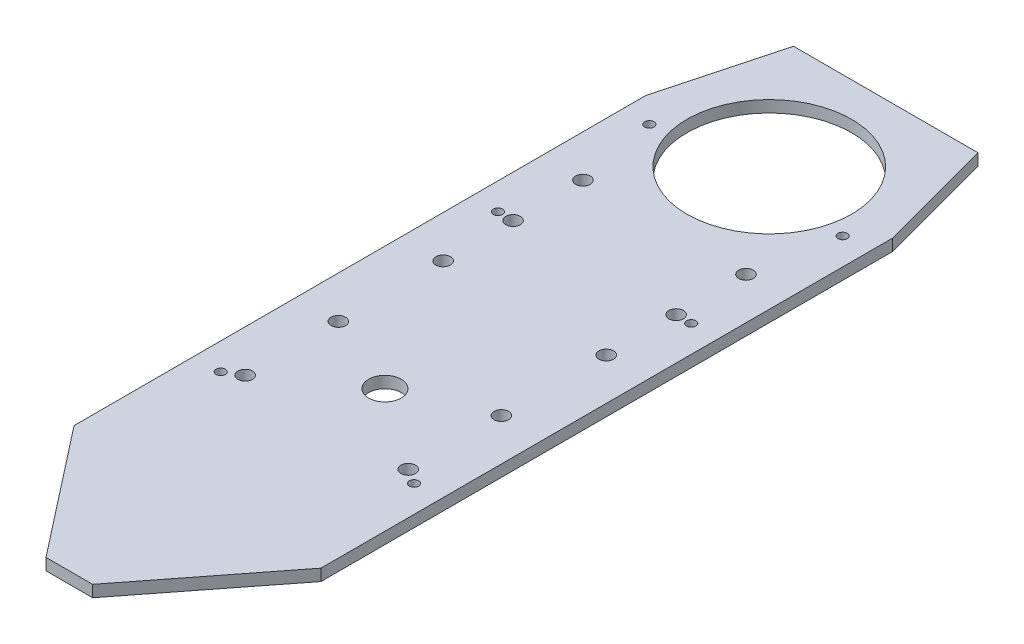
ISO-10303-21;
HEADER;
FILE_DESCRIPTION(('STEP AP214'),'2;1');
FILE_NAME('part.step','',(''),(''),'','','');
FILE_SCHEMA(('AUTOMOTIVE_DESIGN { 1 0 10303 214 1 1 1 1 }'));
ENDSEC;
DATA;
#1=APPLICATION_CONTEXT('core data for automotive mechanical design processes');
#2=APPLICATION_PROTOCOL_DEFINITION('international standard','automotive_design',2000,#1);
#3=PRODUCT_CONTEXT('',#1,'mechanical');
#4=PRODUCT('Part','Part','',(#3));
#5=PRODUCT_RELATED_PRODUCT_CATEGORY('part','',(#4));
#6=PRODUCT_DEFINITION_FORMATION('','',#4);
#7=PRODUCT_DEFINITION_CONTEXT('part definition',#1,'design');
#8=PRODUCT_DEFINITION('design','',#6,#7);
#9=PRODUCT_DEFINITION_SHAPE('','',#8);
#10=(LENGTH_UNIT() NAMED_UNIT(*) SI_UNIT(.MILLI.,.METRE.));
#11=(NAMED_UNIT(*) PLANE_ANGLE_UNIT() SI_UNIT($,.RADIAN.));
#12=(NAMED_UNIT(*) SI_UNIT($,.STERADIAN.) SOLID_ANGLE_UNIT());
#13=UNCERTAINTY_MEASURE_WITH_UNIT(LENGTH_MEASURE(1.E-05),#10,'distance_accuracy_value','');
#14=(GEOMETRIC_REPRESENTATION_CONTEXT(3) GLOBAL_UNCERTAINTY_ASSIGNED_CONTEXT((#13)) GLOBAL_UNIT_ASSIGNED_CONTEXT((#10,
#11,#12)) REPRESENTATION_CONTEXT('',''));
#15=CARTESIAN_POINT('',(0.,0.,0.));
#16=DIRECTION('',(0.,0.,1.));
#17=DIRECTION('',(1.,0.,0.));
#18=AXIS2_PLACEMENT_3D('',#15,#16,#17);
#19=CARTESIAN_POINT('',(0.,10.,0.));
#20=DIRECTION('',(0.,-1.,0.));
#21=DIRECTION('',(0.,0.,-1.));
#22=AXIS2_PLACEMENT_3D('',#19,#20,#21);
#23=PLANE('',#22);
#24=CARTESIAN_POINT('',(-70.,10.,380.));
#25=DIRECTION('',(0.,1.,0.));
#26=DIRECTION('',(0.,0.,1.));
#27=AXIS2_PLACEMENT_3D('',#24,#25,#26);
#28=CIRCLE('',#27,6.25);
#29=CARTESIAN_POINT('',(-70.,10.,386.25));
#30=VERTEX_POINT('',#29);
#31=EDGE_CURVE('E202',#30,#30,#28,.T.);
#32=ORIENTED_EDGE('',*,*,#31,.F.);
#33=EDGE_LOOP('',(#32));
#34=FACE_BOUND('',#33,.T.);
#35=CARTESIAN_POINT('',(83.,10.,20.));
#36=DIRECTION('',(0.,1.,0.));
#37=DIRECTION('',(0.,0.,-1.));
#38=AXIS2_PLACEMENT_3D('',#35,#36,#37);
#39=CIRCLE('',#38,4.00000000000001);
#40=CARTESIAN_POINT('',(83.,10.,16.));
#41=VERTEX_POINT('',#40);
#42=EDGE_CURVE('E225',#41,#41,#39,.T.);
#43=ORIENTED_EDGE('',*,*,#42,.F.);
#44=EDGE_LOOP('',(#43));
#45=FACE_BOUND('',#44,.T.);
#46=CARTESIAN_POINT('',(-70.,10.,300.));
#47=DIRECTION('',(0.,1.,0.));
#48=DIRECTION('',(0.,0.,1.));
#49=AXIS2_PLACEMENT_3D('',#46,#47,#48);
#50=CIRCLE('',#49,6.25);
#51=CARTESIAN_POINT('',(-70.,10.,306.25));
#52=VERTEX_POINT('',#51);
#53=EDGE_CURVE('E226',#52,#52,#50,.T.);
#54=ORIENTED_EDGE('',*,*,#53,.F.);
#55=EDGE_LOOP('',(#54));
#56=FACE_BOUND('',#55,.T.);
#57=CARTESIAN_POINT('',(-70.,10.,210.));
#58=DIRECTION('',(0.,1.,0.));
#59=DIRECTION('',(0.,0.,1.));
#60=AXIS2_PLACEMENT_3D('',#57,#58,#59);
#61=CIRCLE('',#60,6.25);
#62=CARTESIAN_POINT('',(-70.,10.,216.25));
#63=VERTEX_POINT('',#62);
#64=EDGE_CURVE('E237',#63,#63,#61,.T.);
#65=ORIENTED_EDGE('',*,*,#64,.F.);
#66=EDGE_LOOP('',(#65));
#67=FACE_BOUND('',#66,.T.);
#68=CARTESIAN_POINT('',(-83.,10.,20.));
#69=DIRECTION('',(0.,1.,0.));
#70=DIRECTION('',(0.,0.,1.));
#71=AXIS2_PLACEMENT_3D('',#68,#69,#70);
#72=CIRCLE('',#71,4.00000000000001);
#73=CARTESIAN_POINT('',(-83.,10.,24.));
#74=VERTEX_POINT('',#73);
#75=EDGE_CURVE('E201',#74,#74,#72,.T.);
#76=ORIENTED_EDGE('',*,*,#75,.F.);
#77=EDGE_LOOP('',(#76));
#78=FACE_BOUND('',#77,.T.);
#79=CARTESIAN_POINT('',(83.,10.,150.));
#80=DIRECTION('',(0.,1.,0.));
#81=DIRECTION('',(0.,0.,-1.));
#82=AXIS2_PLACEMENT_3D('',#79,#80,#81);
#83=CIRCLE('',#82,4.00000000000002);
#84=CARTESIAN_POINT('',(83.,10.,146.));
#85=VERTEX_POINT('',#84);
#86=EDGE_CURVE('E208',#85,#85,#83,.T.);
#87=ORIENTED_EDGE('',*,*,#86,.F.);
#88=EDGE_LOOP('',(#87));
#89=FACE_BOUND('',#88,.T.);
#90=CARTESIAN_POINT('',(83.,10.,388.));
#91=DIRECTION('',(0.,1.,0.));
#92=DIRECTION('',(0.,0.,-1.));
#93=AXIS2_PLACEMENT_3D('',#90,#91,#92);
#94=CIRCLE('',#93,4.00000000000002);
#95=CARTESIAN_POINT('',(83.,10.,384.));
#96=VERTEX_POINT('',#95);
#97=EDGE_CURVE('E214',#96,#96,#94,.T.);
#98=ORIENTED_EDGE('',*,*,#97,.F.);
#99=EDGE_LOOP('',(#98));
#100=FACE_BOUND('',#99,.T.);
#101=CARTESIAN_POINT('',(-82.9999999999999,10.,388.));
#102=DIRECTION('',(0.,1.,0.));
#103=DIRECTION('',(0.,0.,1.));
#104=AXIS2_PLACEMENT_3D('',#101,#102,#103);
#105=CIRCLE('',#104,4.00000000000002);
#106=CARTESIAN_POINT('',(-82.9999999999999,10.,392.));
#107=VERTEX_POINT('',#106);
#108=EDGE_CURVE('E195',#107,#107,#105,.T.);
#109=ORIENTED_EDGE('',*,*,#108,.F.);
#110=EDGE_LOOP('',(#109));
#111=FACE_BOUND('',#110,.T.);
#112=CARTESIAN_POINT('',(-70.,10.,150.));
#113=DIRECTION('',(0.,1.,0.));
#114=DIRECTION('',(0.,0.,1.));
#115=AXIS2_PLACEMENT_3D('',#112,#113,#114);
#116=CIRCLE('',#115,6.25);
#117=CARTESIAN_POINT('',(-70.,10.,156.25));
#118=VERTEX_POINT('',#117);
#119=EDGE_CURVE('E238',#118,#118,#116,.T.);
#120=ORIENTED_EDGE('',*,*,#119,.F.);
#121=EDGE_LOOP('',(#120));
#122=FACE_BOUND('',#121,.T.);
#123=CARTESIAN_POINT('',(-70.,10.,90.));
#124=DIRECTION('',(0.,1.,0.));
#125=DIRECTION('',(0.,0.,1.));
#126=AXIS2_PLACEMENT_3D('',#123,#124,#125);
#127=CIRCLE('',#126,6.25);
#128=CARTESIAN_POINT('',(-70.,10.,96.25));
#129=VERTEX_POINT('',#128);
#130=EDGE_CURVE('E279',#129,#129,#127,.T.);
#131=ORIENTED_EDGE('',*,*,#130,.F.);
#132=EDGE_LOOP('',(#131));
#133=FACE_BOUND('',#132,.T.);
#134=CARTESIAN_POINT('',(70.,10.,90.));
#135=DIRECTION('',(0.,1.,0.));
#136=DIRECTION('',(0.,0.,-1.));
#137=AXIS2_PLACEMENT_3D('',#134,#135,#136);
#138=CIRCLE('',#137,6.25);
#139=CARTESIAN_POINT('',(70.,10.,83.75));
#140=VERTEX_POINT('',#139);
#141=EDGE_CURVE('E273',#140,#140,#138,.T.);
#142=ORIENTED_EDGE('',*,*,#141,.F.);
#143=EDGE_LOOP('',(#142));
#144=FACE_BOUND('',#143,.T.);
#145=CARTESIAN_POINT('',(70.,10.,150.));
#146=DIRECTION('',(0.,1.,0.));
#147=DIRECTION('',(0.,0.,-1.));
#148=AXIS2_PLACEMENT_3D('',#145,#146,#147);
#149=CIRCLE('',#148,6.25);
#150=CARTESIAN_POINT('',(70.,10.,143.75));
#151=VERTEX_POINT('',#150);
#152=EDGE_CURVE('E267',#151,#151,#149,.T.);
#153=ORIENTED_EDGE('',*,*,#152,.F.);
#154=EDGE_LOOP('',(#153));
#155=FACE_BOUND('',#154,.T.);
#156=CARTESIAN_POINT('',(70.,10.,210.));
#157=DIRECTION('',(0.,1.,0.));
#158=DIRECTION('',(0.,0.,-1.));
#159=AXIS2_PLACEMENT_3D('',#156,#157,#158);
#160=CIRCLE('',#159,6.25);
#161=CARTESIAN_POINT('',(70.,10.,203.75));
#162=VERTEX_POINT('',#161);
#163=EDGE_CURVE('E261',#162,#162,#160,.T.);
#164=ORIENTED_EDGE('',*,*,#163,.F.);
#165=EDGE_LOOP('',(#164));
#166=FACE_BOUND('',#165,.T.);
#167=CARTESIAN_POINT('',(70.,10.,300.));
#168=DIRECTION('',(0.,1.,0.));
#169=DIRECTION('',(0.,0.,-1.));
#170=AXIS2_PLACEMENT_3D('',#167,#168,#169);
#171=CIRCLE('',#170,6.25);
#172=CARTESIAN_POINT('',(70.,10.,293.75));
#173=VERTEX_POINT('',#172);
#174=EDGE_CURVE('E255',#173,#173,#171,.T.);
#175=ORIENTED_EDGE('',*,*,#174,.F.);
#176=EDGE_LOOP('',(#175));
#177=FACE_BOUND('',#176,.T.);
#178=CARTESIAN_POINT('',(70.,10.,380.));
#179=DIRECTION('',(0.,1.,0.));
#180=DIRECTION('',(0.,0.,-1.));
#181=AXIS2_PLACEMENT_3D('',#178,#179,#180);
#182=CIRCLE('',#181,6.25);
#183=CARTESIAN_POINT('',(70.,10.,373.75));
#184=VERTEX_POINT('',#183);
#185=EDGE_CURVE('E249',#184,#184,#182,.T.);
#186=ORIENTED_EDGE('',*,*,#185,.F.);
#187=EDGE_LOOP('',(#186));
#188=FACE_BOUND('',#187,.T.);
#189=CARTESIAN_POINT('',(-82.9999999999999,10.,150.));
#190=DIRECTION('',(0.,1.,0.));
#191=DIRECTION('',(0.,0.,1.));
#192=AXIS2_PLACEMENT_3D('',#189,#190,#191);
#193=CIRCLE('',#192,4.00000000000002);
#194=CARTESIAN_POINT('',(-82.9999999999999,10.,154.));
#195=VERTEX_POINT('',#194);
#196=EDGE_CURVE('E189',#195,#195,#193,.T.);
#197=ORIENTED_EDGE('',*,*,#196,.F.);
#198=EDGE_LOOP('',(#197));
#199=FACE_BOUND('',#198,.T.);
#200=DIRECTION('',(0.615661475325656,0.,0.788010753606723));
#201=VECTOR('',#200,1.);
#202=CARTESIAN_POINT('',(-19.9999999999999,10.,601.));
#203=LINE('',#202,#201);
#204=CARTESIAN_POINT('',(-106.,10.,490.925019631395));
#205=VERTEX_POINT('',#204);
#206=CARTESIAN_POINT('',(-19.9999999999999,10.,601.));
#207=VERTEX_POINT('',#206);
#208=EDGE_CURVE('E146',#205,#207,#203,.T.);
#209=ORIENTED_EDGE('',*,*,#208,.T.);
#210=DIRECTION('',(1.,0.,0.));
#211=VECTOR('',#210,1.);
#212=CARTESIAN_POINT('',(-19.9999999999999,10.,601.));
#213=LINE('',#212,#211);
#214=CARTESIAN_POINT('',(20.0000000000001,10.,601.));
#215=VERTEX_POINT('',#214);
#216=EDGE_CURVE('E94',#207,#215,#213,.T.);
#217=ORIENTED_EDGE('',*,*,#216,.T.);
#218=DIRECTION('',(0.615661475325656,0.,-0.788010753606723));
#219=VECTOR('',#218,1.);
#220=CARTESIAN_POINT('',(20.0000000000001,10.,601.));
#221=LINE('',#220,#219);
#222=CARTESIAN_POINT('',(106.,10.,490.925019631395));
#223=VERTEX_POINT('',#222);
#224=EDGE_CURVE('E161',#215,#223,#221,.T.);
#225=ORIENTED_EDGE('',*,*,#224,.T.);
#226=DIRECTION('',(0.,0.,-1.));
#227=VECTOR('',#226,1.);
#228=CARTESIAN_POINT('',(106.,10.,490.925019631395));
#229=LINE('',#228,#227);
#230=CARTESIAN_POINT('',(106.,10.,0.));
#231=VERTEX_POINT('',#230);
#232=EDGE_CURVE('E174',#223,#231,#229,.T.);
#233=ORIENTED_EDGE('',*,*,#232,.T.);
#234=DIRECTION('',(-0.258819045102525,0.,-0.965925826289067));
#235=VECTOR('',#234,1.);
#236=CARTESIAN_POINT('',(106.,10.,0.));
#237=LINE('',#236,#235);
#238=CARTESIAN_POINT('',(79.2050807568873,10.,-100.));
#239=VERTEX_POINT('',#238);
#240=EDGE_CURVE('E113',#231,#239,#237,.T.);
#241=ORIENTED_EDGE('',*,*,#240,.T.);
#242=DIRECTION('',(-1.,0.,0.));
#243=VECTOR('',#242,1.);
#244=CARTESIAN_POINT('',(79.2050807568873,10.,-100.));
#245=LINE('',#244,#243);
#246=CARTESIAN_POINT('',(-79.2050807568874,10.,-100.));
#247=VERTEX_POINT('',#246);
#248=EDGE_CURVE('E107',#239,#247,#245,.T.);
#249=ORIENTED_EDGE('',*,*,#248,.T.);
#250=DIRECTION('',(-0.258819045102525,0.,0.965925826289067));
#251=VECTOR('',#250,1.);
#252=CARTESIAN_POINT('',(-106.,10.,0.));
#253=LINE('',#252,#251);
#254=CARTESIAN_POINT('',(-106.,10.,0.));
#255=VERTEX_POINT('',#254);
#256=EDGE_CURVE('E111',#247,#255,#253,.T.);
#257=ORIENTED_EDGE('',*,*,#256,.T.);
#258=DIRECTION('',(0.,0.,1.));
#259=VECTOR('',#258,1.);
#260=CARTESIAN_POINT('',(-106.,10.,490.925019631395));
#261=LINE('',#260,#259);
#262=EDGE_CURVE('E51',#255,#205,#261,.T.);
#263=ORIENTED_EDGE('',*,*,#262,.T.);
#264=EDGE_LOOP('',(#209,#217,#225,#233,#241,#249,#257,#263));
#265=FACE_BOUND('',#264,.T.);
#266=CARTESIAN_POINT('',(0.,10.,0.));
#267=DIRECTION('',(0.,1.,0.));
#268=DIRECTION('',(0.,0.,1.));
#269=AXIS2_PLACEMENT_3D('',#266,#267,#268);
#270=CIRCLE('',#269,70.65);
#271=CARTESIAN_POINT('',(0.,10.,70.65));
#272=VERTEX_POINT('',#271);
#273=EDGE_CURVE('E135',#272,#272,#270,.T.);
#274=ORIENTED_EDGE('',*,*,#273,.F.);
#275=EDGE_LOOP('',(#274));
#276=FACE_BOUND('',#275,.T.);
#277=CARTESIAN_POINT('',(0.,10.,330.));
#278=DIRECTION('',(0.,1.,0.));
#279=DIRECTION('',(0.,0.,1.));
#280=AXIS2_PLACEMENT_3D('',#277,#278,#279);
#281=CIRCLE('',#280,14.);
#282=CARTESIAN_POINT('',(0.,10.,344.));
#283=VERTEX_POINT('',#282);
#284=EDGE_CURVE('E183',#283,#283,#281,.T.);
#285=ORIENTED_EDGE('',*,*,#284,.F.);
#286=EDGE_LOOP('',(#285));
#287=FACE_BOUND('',#286,.T.);
#288=ADVANCED_FACE('F34',(#34,#45,#56,#67,#78,#89,#100,#111,#122,#133,#144,#155,#166,#177,#188,
#199,#265,#276,#287),#23,.F.);
#289=CARTESIAN_POINT('',(0.,0.,0.));
#290=DIRECTION('',(0.,-1.,0.));
#291=DIRECTION('',(0.,0.,-1.));
#292=AXIS2_PLACEMENT_3D('',#289,#290,#291);
#293=PLANE('',#292);
#294=CARTESIAN_POINT('',(-70.,0.,380.));
#295=DIRECTION('',(0.,-1.,0.));
#296=DIRECTION('',(0.,0.,-1.));
#297=AXIS2_PLACEMENT_3D('',#294,#295,#296);
#298=CIRCLE('',#297,6.25);
#299=CARTESIAN_POINT('',(-70.,0.,373.75));
#300=VERTEX_POINT('',#299);
#301=EDGE_CURVE('E229',#300,#300,#298,.F.);
#302=ORIENTED_EDGE('',*,*,#301,.T.);
#303=EDGE_LOOP('',(#302));
#304=FACE_BOUND('',#303,.T.);
#305=CARTESIAN_POINT('',(83.,0.,20.));
#306=DIRECTION('',(0.,-1.,0.));
#307=DIRECTION('',(0.,0.,-1.));
#308=AXIS2_PLACEMENT_3D('',#305,#306,#307);
#309=CIRCLE('',#308,4.00000000000001);
#310=CARTESIAN_POINT('',(83.,0.,16.));
#311=VERTEX_POINT('',#310);
#312=EDGE_CURVE('E222',#311,#311,#309,.F.);
#313=ORIENTED_EDGE('',*,*,#312,.T.);
#314=EDGE_LOOP('',(#313));
#315=FACE_BOUND('',#314,.T.);
#316=CARTESIAN_POINT('',(-70.,0.,300.));
#317=DIRECTION('',(0.,-1.,0.));
#318=DIRECTION('',(0.,0.,-1.));
#319=AXIS2_PLACEMENT_3D('',#316,#317,#318);
#320=CIRCLE('',#319,6.25);
#321=CARTESIAN_POINT('',(-70.,0.,293.75));
#322=VERTEX_POINT('',#321);
#323=EDGE_CURVE('E241',#322,#322,#320,.F.);
#324=ORIENTED_EDGE('',*,*,#323,.T.);
#325=EDGE_LOOP('',(#324));
#326=FACE_BOUND('',#325,.T.);
#327=CARTESIAN_POINT('',(-70.,0.,210.));
#328=DIRECTION('',(0.,-1.,0.));
#329=DIRECTION('',(0.,0.,-1.));
#330=AXIS2_PLACEMENT_3D('',#327,#328,#329);
#331=CIRCLE('',#330,6.25);
#332=CARTESIAN_POINT('',(-70.,0.,203.75));
#333=VERTEX_POINT('',#332);
#334=EDGE_CURVE('E234',#333,#333,#331,.F.);
#335=ORIENTED_EDGE('',*,*,#334,.T.);
#336=EDGE_LOOP('',(#335));
#337=FACE_BOUND('',#336,.T.);
#338=CARTESIAN_POINT('',(-83.,0.,20.));
#339=DIRECTION('',(0.,-1.,0.));
#340=DIRECTION('',(0.,0.,-1.));
#341=AXIS2_PLACEMENT_3D('',#338,#339,#340);
#342=CIRCLE('',#341,4.00000000000001);
#343=CARTESIAN_POINT('',(-83.,0.,16.));
#344=VERTEX_POINT('',#343);
#345=EDGE_CURVE('E198',#344,#344,#342,.F.);
#346=ORIENTED_EDGE('',*,*,#345,.T.);
#347=EDGE_LOOP('',(#346));
#348=FACE_BOUND('',#347,.T.);
#349=CARTESIAN_POINT('',(83.,0.,150.));
#350=DIRECTION('',(0.,-1.,0.));
#351=DIRECTION('',(0.,0.,-1.));
#352=AXIS2_PLACEMENT_3D('',#349,#350,#351);
#353=CIRCLE('',#352,4.00000000000002);
#354=CARTESIAN_POINT('',(83.,0.,146.));
#355=VERTEX_POINT('',#354);
#356=EDGE_CURVE('E205',#355,#355,#353,.F.);
#357=ORIENTED_EDGE('',*,*,#356,.T.);
#358=EDGE_LOOP('',(#357));
#359=FACE_BOUND('',#358,.T.);
#360=CARTESIAN_POINT('',(83.,0.,388.));
#361=DIRECTION('',(0.,-1.,0.));
#362=DIRECTION('',(0.,0.,-1.));
#363=AXIS2_PLACEMENT_3D('',#360,#361,#362);
#364=CIRCLE('',#363,4.00000000000002);
#365=CARTESIAN_POINT('',(83.,0.,384.));
#366=VERTEX_POINT('',#365);
#367=EDGE_CURVE('E211',#366,#366,#364,.F.);
#368=ORIENTED_EDGE('',*,*,#367,.T.);
#369=EDGE_LOOP('',(#368));
#370=FACE_BOUND('',#369,.T.);
#371=CARTESIAN_POINT('',(-82.9999999999999,0.,388.));
#372=DIRECTION('',(0.,-1.,0.));
#373=DIRECTION('',(0.,0.,-1.));
#374=AXIS2_PLACEMENT_3D('',#371,#372,#373);
#375=CIRCLE('',#374,4.00000000000002);
#376=CARTESIAN_POINT('',(-82.9999999999999,0.,384.));
#377=VERTEX_POINT('',#376);
#378=EDGE_CURVE('E217',#377,#377,#375,.F.);
#379=ORIENTED_EDGE('',*,*,#378,.T.);
#380=EDGE_LOOP('',(#379));
#381=FACE_BOUND('',#380,.T.);
#382=CARTESIAN_POINT('',(-70.,0.,150.));
#383=DIRECTION('',(0.,-1.,0.));
#384=DIRECTION('',(0.,0.,-1.));
#385=AXIS2_PLACEMENT_3D('',#382,#383,#384);
#386=CIRCLE('',#385,6.25);
#387=CARTESIAN_POINT('',(-70.,0.,143.75));
#388=VERTEX_POINT('',#387);
#389=EDGE_CURVE('E282',#388,#388,#386,.F.);
#390=ORIENTED_EDGE('',*,*,#389,.T.);
#391=EDGE_LOOP('',(#390));
#392=FACE_BOUND('',#391,.T.);
#393=CARTESIAN_POINT('',(-70.,0.,90.));
#394=DIRECTION('',(0.,-1.,0.));
#395=DIRECTION('',(0.,0.,-1.));
#396=AXIS2_PLACEMENT_3D('',#393,#394,#395);
#397=CIRCLE('',#396,6.25);
#398=CARTESIAN_POINT('',(-70.,0.,83.75));
#399=VERTEX_POINT('',#398);
#400=EDGE_CURVE('E276',#399,#399,#397,.F.);
#401=ORIENTED_EDGE('',*,*,#400,.T.);
#402=EDGE_LOOP('',(#401));
#403=FACE_BOUND('',#402,.T.);
#404=CARTESIAN_POINT('',(70.,0.,90.));
#405=DIRECTION('',(0.,-1.,0.));
#406=DIRECTION('',(0.,0.,-1.));
#407=AXIS2_PLACEMENT_3D('',#404,#405,#406);
#408=CIRCLE('',#407,6.25);
#409=CARTESIAN_POINT('',(70.,0.,83.75));
#410=VERTEX_POINT('',#409);
#411=EDGE_CURVE('E270',#410,#410,#408,.F.);
#412=ORIENTED_EDGE('',*,*,#411,.T.);
#413=EDGE_LOOP('',(#412));
#414=FACE_BOUND('',#413,.T.);
#415=CARTESIAN_POINT('',(70.,0.,150.));
#416=DIRECTION('',(0.,-1.,0.));
#417=DIRECTION('',(0.,0.,-1.));
#418=AXIS2_PLACEMENT_3D('',#415,#416,#417);
#419=CIRCLE('',#418,6.25);
#420=CARTESIAN_POINT('',(70.,0.,143.75));
#421=VERTEX_POINT('',#420);
#422=EDGE_CURVE('E264',#421,#421,#419,.F.);
#423=ORIENTED_EDGE('',*,*,#422,.T.);
#424=EDGE_LOOP('',(#423));
#425=FACE_BOUND('',#424,.T.);
#426=CARTESIAN_POINT('',(70.,0.,210.));
#427=DIRECTION('',(0.,-1.,0.));
#428=DIRECTION('',(0.,0.,-1.));
#429=AXIS2_PLACEMENT_3D('',#426,#427,#428);
#430=CIRCLE('',#429,6.25);
#431=CARTESIAN_POINT('',(70.,0.,203.75));
#432=VERTEX_POINT('',#431);
#433=EDGE_CURVE('E258',#432,#432,#430,.F.);
#434=ORIENTED_EDGE('',*,*,#433,.T.);
#435=EDGE_LOOP('',(#434));
#436=FACE_BOUND('',#435,.T.);
#437=CARTESIAN_POINT('',(70.,0.,300.));
#438=DIRECTION('',(0.,-1.,0.));
#439=DIRECTION('',(0.,0.,-1.));
#440=AXIS2_PLACEMENT_3D('',#437,#438,#439);
#441=CIRCLE('',#440,6.25);
#442=CARTESIAN_POINT('',(70.,0.,293.75));
#443=VERTEX_POINT('',#442);
#444=EDGE_CURVE('E252',#443,#443,#441,.F.);
#445=ORIENTED_EDGE('',*,*,#444,.T.);
#446=EDGE_LOOP('',(#445));
#447=FACE_BOUND('',#446,.T.);
#448=CARTESIAN_POINT('',(70.,0.,380.));
#449=DIRECTION('',(0.,-1.,0.));
#450=DIRECTION('',(0.,0.,-1.));
#451=AXIS2_PLACEMENT_3D('',#448,#449,#450);
#452=CIRCLE('',#451,6.25);
#453=CARTESIAN_POINT('',(70.,0.,373.75));
#454=VERTEX_POINT('',#453);
#455=EDGE_CURVE('E246',#454,#454,#452,.F.);
#456=ORIENTED_EDGE('',*,*,#455,.T.);
#457=EDGE_LOOP('',(#456));
#458=FACE_BOUND('',#457,.T.);
#459=CARTESIAN_POINT('',(-82.9999999999999,0.,150.));
#460=DIRECTION('',(0.,-1.,0.));
#461=DIRECTION('',(0.,0.,-1.));
#462=AXIS2_PLACEMENT_3D('',#459,#460,#461);
#463=CIRCLE('',#462,4.00000000000002);
#464=CARTESIAN_POINT('',(-82.9999999999999,0.,146.));
#465=VERTEX_POINT('',#464);
#466=EDGE_CURVE('E192',#465,#465,#463,.F.);
#467=ORIENTED_EDGE('',*,*,#466,.T.);
#468=EDGE_LOOP('',(#467));
#469=FACE_BOUND('',#468,.T.);
#470=CARTESIAN_POINT('',(0.,0.,0.));
#471=DIRECTION('',(0.,1.,0.));
#472=DIRECTION('',(0.,0.,1.));
#473=AXIS2_PLACEMENT_3D('',#470,#471,#472);
#474=CIRCLE('',#473,70.65);
#475=CARTESIAN_POINT('',(0.,0.,70.65));
#476=VERTEX_POINT('',#475);
#477=EDGE_CURVE('E180',#476,#476,#474,.T.);
#478=ORIENTED_EDGE('',*,*,#477,.T.);
#479=EDGE_LOOP('',(#478));
#480=FACE_BOUND('',#479,.T.);
#481=DIRECTION('',(0.615661475325656,0.,0.788010753606723));
#482=VECTOR('',#481,1.);
#483=CARTESIAN_POINT('',(-19.9999999999999,0.,601.));
#484=LINE('',#483,#482);
#485=CARTESIAN_POINT('',(-106.,0.,490.925019631395));
#486=VERTEX_POINT('',#485);
#487=CARTESIAN_POINT('',(-19.9999999999999,0.,601.));
#488=VERTEX_POINT('',#487);
#489=EDGE_CURVE('E131',#486,#488,#484,.T.);
#490=ORIENTED_EDGE('',*,*,#489,.F.);
#491=DIRECTION('',(0.,0.,1.));
#492=VECTOR('',#491,1.);
#493=CARTESIAN_POINT('',(-106.,0.,490.925019631395));
#494=LINE('',#493,#492);
#495=CARTESIAN_POINT('',(-106.,0.,0.));
#496=VERTEX_POINT('',#495);
#497=EDGE_CURVE('E86',#496,#486,#494,.T.);
#498=ORIENTED_EDGE('',*,*,#497,.F.);
#499=DIRECTION('',(-0.258819045102525,0.,0.965925826289067));
#500=VECTOR('',#499,1.);
#501=CARTESIAN_POINT('',(-106.,0.,0.));
#502=LINE('',#501,#500);
#503=CARTESIAN_POINT('',(-79.2050807568874,0.,-100.));
#504=VERTEX_POINT('',#503);
#505=EDGE_CURVE('E80',#504,#496,#502,.T.);
#506=ORIENTED_EDGE('',*,*,#505,.F.);
#507=DIRECTION('',(-1.,0.,0.));
#508=VECTOR('',#507,1.);
#509=CARTESIAN_POINT('',(79.2050807568873,0.,-100.));
#510=LINE('',#509,#508);
#511=CARTESIAN_POINT('',(79.2050807568873,0.,-100.));
#512=VERTEX_POINT('',#511);
#513=EDGE_CURVE('E121',#512,#504,#510,.T.);
#514=ORIENTED_EDGE('',*,*,#513,.F.);
#515=DIRECTION('',(-0.258819045102525,0.,-0.965925826289067));
#516=VECTOR('',#515,1.);
#517=CARTESIAN_POINT('',(106.,0.,0.));
#518=LINE('',#517,#516);
#519=CARTESIAN_POINT('',(106.,0.,0.));
#520=VERTEX_POINT('',#519);
#521=EDGE_CURVE('E141',#520,#512,#518,.T.);
#522=ORIENTED_EDGE('',*,*,#521,.F.);
#523=DIRECTION('',(0.,0.,-1.));
#524=VECTOR('',#523,1.);
#525=CARTESIAN_POINT('',(106.,0.,490.925019631395));
#526=LINE('',#525,#524);
#527=CARTESIAN_POINT('',(106.,0.,490.925019631395));
#528=VERTEX_POINT('',#527);
#529=EDGE_CURVE('E139',#528,#520,#526,.T.);
#530=ORIENTED_EDGE('',*,*,#529,.F.);
#531=DIRECTION('',(0.615661475325656,0.,-0.788010753606723));
#532=VECTOR('',#531,1.);
#533=CARTESIAN_POINT('',(20.0000000000001,0.,601.));
#534=LINE('',#533,#532);
#535=CARTESIAN_POINT('',(20.0000000000001,0.,601.));
#536=VERTEX_POINT('',#535);
#537=EDGE_CURVE('E137',#536,#528,#534,.T.);
#538=ORIENTED_EDGE('',*,*,#537,.F.);
#539=DIRECTION('',(1.,0.,0.));
#540=VECTOR('',#539,1.);
#541=CARTESIAN_POINT('',(-19.9999999999999,0.,601.));
#542=LINE('',#541,#540);
#543=EDGE_CURVE('E134',#488,#536,#542,.T.);
#544=ORIENTED_EDGE('',*,*,#543,.F.);
#545=EDGE_LOOP('',(#490,#498,#506,#514,#522,#530,#538,#544));
#546=FACE_BOUND('',#545,.T.);
#547=CARTESIAN_POINT('',(0.,0.,330.));
#548=DIRECTION('',(0.,1.,0.));
#549=DIRECTION('',(0.,0.,1.));
#550=AXIS2_PLACEMENT_3D('',#547,#548,#549);
#551=CIRCLE('',#550,14.);
#552=CARTESIAN_POINT('',(0.,0.,344.));
#553=VERTEX_POINT('',#552);
#554=EDGE_CURVE('E186',#553,#553,#551,.T.);
#555=ORIENTED_EDGE('',*,*,#554,.T.);
#556=EDGE_LOOP('',(#555));
#557=FACE_BOUND('',#556,.T.);
#558=ADVANCED_FACE('F165',(#304,#315,#326,#337,#348,#359,#370,#381,#392,#403,#414,#425,#436,
#447,#458,#469,#480,#546,#557),#293,.T.);
#559=CARTESIAN_POINT('',(-19.9999999999999,10.,601.));
#560=DIRECTION('',(0.788010753606723,0.,-0.615661475325656));
#561=DIRECTION('',(-0.615661475325656,0.,-0.788010753606723));
#562=AXIS2_PLACEMENT_3D('',#559,#560,#561);
#563=PLANE('',#562);
#564=ORIENTED_EDGE('',*,*,#489,.T.);
#565=DIRECTION('',(0.,-1.,0.));
#566=VECTOR('',#565,1.);
#567=CARTESIAN_POINT('',(-19.9999999999999,10.,601.));
#568=LINE('',#567,#566);
#569=EDGE_CURVE('E11',#207,#488,#568,.T.);
#570=ORIENTED_EDGE('',*,*,#569,.F.);
#571=ORIENTED_EDGE('',*,*,#208,.F.);
#572=DIRECTION('',(0.,-1.,0.));
#573=VECTOR('',#572,1.);
#574=CARTESIAN_POINT('',(-106.,10.,490.925019631395));
#575=LINE('',#574,#573);
#576=EDGE_CURVE('E127',#205,#486,#575,.T.);
#577=ORIENTED_EDGE('',*,*,#576,.T.);
#578=EDGE_LOOP('',(#564,#570,#571,#577));
#579=FACE_BOUND('',#578,.T.);
#580=ADVANCED_FACE('F36',(#579),#563,.F.);
#581=CARTESIAN_POINT('',(-19.9999999999999,10.,601.));
#582=DIRECTION('',(0.,0.,-1.));
#583=DIRECTION('',(-1.,0.,0.));
#584=AXIS2_PLACEMENT_3D('',#581,#582,#583);
#585=PLANE('',#584);
#586=ORIENTED_EDGE('',*,*,#543,.T.);
#587=DIRECTION('',(0.,-1.,0.));
#588=VECTOR('',#587,1.);
#589=CARTESIAN_POINT('',(20.0000000000001,10.,601.));
#590=LINE('',#589,#588);
#591=EDGE_CURVE('E43',#215,#536,#590,.T.);
#592=ORIENTED_EDGE('',*,*,#591,.F.);
#593=ORIENTED_EDGE('',*,*,#216,.F.);
#594=ORIENTED_EDGE('',*,*,#569,.T.);
#595=EDGE_LOOP('',(#586,#592,#593,#594));
#596=FACE_BOUND('',#595,.T.);
#597=ADVANCED_FACE('F347',(#596),#585,.F.);
#598=CARTESIAN_POINT('',(20.0000000000001,10.,601.));
#599=DIRECTION('',(-0.788010753606723,0.,-0.615661475325656));
#600=DIRECTION('',(-0.615661475325656,0.,0.788010753606723));
#601=AXIS2_PLACEMENT_3D('',#598,#599,#600);
#602=PLANE('',#601);
#603=ORIENTED_EDGE('',*,*,#537,.T.);
#604=DIRECTION('',(0.,-1.,0.));
#605=VECTOR('',#604,1.);
#606=CARTESIAN_POINT('',(106.,10.,490.925019631395));
#607=LINE('',#606,#605);
#608=EDGE_CURVE('E153',#223,#528,#607,.T.);
#609=ORIENTED_EDGE('',*,*,#608,.F.);
#610=ORIENTED_EDGE('',*,*,#224,.F.);
#611=ORIENTED_EDGE('',*,*,#591,.T.);
#612=EDGE_LOOP('',(#603,#609,#610,#611));
#613=FACE_BOUND('',#612,.T.);
#614=ADVANCED_FACE('F159',(#613),#602,.F.);
#615=CARTESIAN_POINT('',(106.,10.,490.925019631395));
#616=DIRECTION('',(-1.,0.,0.));
#617=DIRECTION('',(0.,0.,1.));
#618=AXIS2_PLACEMENT_3D('',#615,#616,#617);
#619=PLANE('',#618);
#620=ORIENTED_EDGE('',*,*,#529,.T.);
#621=DIRECTION('',(0.,-1.,0.));
#622=VECTOR('',#621,1.);
#623=CARTESIAN_POINT('',(106.,10.,0.));
#624=LINE('',#623,#622);
#625=EDGE_CURVE('E150',#231,#520,#624,.T.);
#626=ORIENTED_EDGE('',*,*,#625,.F.);
#627=ORIENTED_EDGE('',*,*,#232,.F.);
#628=ORIENTED_EDGE('',*,*,#608,.T.);
#629=EDGE_LOOP('',(#620,#626,#627,#628));
#630=FACE_BOUND('',#629,.T.);
#631=ADVANCED_FACE('F170',(#630),#619,.F.);
#632=CARTESIAN_POINT('',(106.,10.,0.));
#633=DIRECTION('',(-0.965925826289067,0.,0.258819045102525));
#634=DIRECTION('',(0.258819045102525,0.,0.965925826289067));
#635=AXIS2_PLACEMENT_3D('',#632,#633,#634);
#636=PLANE('',#635);
#637=ORIENTED_EDGE('',*,*,#521,.T.);
#638=DIRECTION('',(0.,-1.,0.));
#639=VECTOR('',#638,1.);
#640=CARTESIAN_POINT('',(79.2050807568873,10.,-100.));
#641=LINE('',#640,#639);
#642=EDGE_CURVE('E122',#239,#512,#641,.T.);
#643=ORIENTED_EDGE('',*,*,#642,.F.);
#644=ORIENTED_EDGE('',*,*,#240,.F.);
#645=ORIENTED_EDGE('',*,*,#625,.T.);
#646=EDGE_LOOP('',(#637,#643,#644,#645));
#647=FACE_BOUND('',#646,.T.);
#648=ADVANCED_FACE('F173',(#647),#636,.F.);
#649=CARTESIAN_POINT('',(79.2050807568873,10.,-100.));
#650=DIRECTION('',(0.,0.,1.));
#651=DIRECTION('',(1.,0.,0.));
#652=AXIS2_PLACEMENT_3D('',#649,#650,#651);
#653=PLANE('',#652);
#654=ORIENTED_EDGE('',*,*,#513,.T.);
#655=DIRECTION('',(0.,-1.,0.));
#656=VECTOR('',#655,1.);
#657=CARTESIAN_POINT('',(-79.2050807568874,10.,-100.));
#658=LINE('',#657,#656);
#659=EDGE_CURVE('E118',#247,#504,#658,.T.);
#660=ORIENTED_EDGE('',*,*,#659,.F.);
#661=ORIENTED_EDGE('',*,*,#248,.F.);
#662=ORIENTED_EDGE('',*,*,#642,.T.);
#663=EDGE_LOOP('',(#654,#660,#661,#662));
#664=FACE_BOUND('',#663,.T.);
#665=ADVANCED_FACE('F119',(#664),#653,.F.);
#666=CARTESIAN_POINT('',(-106.,10.,0.));
#667=DIRECTION('',(0.965925826289067,0.,0.258819045102525));
#668=DIRECTION('',(0.258819045102525,0.,-0.965925826289067));
#669=AXIS2_PLACEMENT_3D('',#666,#667,#668);
#670=PLANE('',#669);
#671=ORIENTED_EDGE('',*,*,#505,.T.);
#672=DIRECTION('',(0.,-1.,0.));
#673=VECTOR('',#672,1.);
#674=CARTESIAN_POINT('',(-106.,10.,0.));
#675=LINE('',#674,#673);
#676=EDGE_CURVE('E123',#255,#496,#675,.T.);
#677=ORIENTED_EDGE('',*,*,#676,.F.);
#678=ORIENTED_EDGE('',*,*,#256,.F.);
#679=ORIENTED_EDGE('',*,*,#659,.T.);
#680=EDGE_LOOP('',(#671,#677,#678,#679));
#681=FACE_BOUND('',#680,.T.);
#682=ADVANCED_FACE('F125',(#681),#670,.F.);
#683=CARTESIAN_POINT('',(-106.,10.,490.925019631395));
#684=DIRECTION('',(1.,0.,0.));
#685=DIRECTION('',(0.,0.,-1.));
#686=AXIS2_PLACEMENT_3D('',#683,#684,#685);
#687=PLANE('',#686);
#688=ORIENTED_EDGE('',*,*,#497,.T.);
#689=ORIENTED_EDGE('',*,*,#576,.F.);
#690=ORIENTED_EDGE('',*,*,#262,.F.);
#691=ORIENTED_EDGE('',*,*,#676,.T.);
#692=EDGE_LOOP('',(#688,#689,#690,#691));
#693=FACE_BOUND('',#692,.T.);
#694=ADVANCED_FACE('F330',(#693),#687,.F.);
#695=CARTESIAN_POINT('',(0.,10.,0.));
#696=DIRECTION('',(0.,-1.,0.));
#697=DIRECTION('',(0.,0.,-1.));
#698=AXIS2_PLACEMENT_3D('',#695,#696,#697);
#699=CYLINDRICAL_SURFACE('',#698,70.65);
#700=ORIENTED_EDGE('',*,*,#273,.T.);
#701=EDGE_LOOP('',(#700));
#702=FACE_BOUND('',#701,.T.);
#703=ORIENTED_EDGE('',*,*,#477,.F.);
#704=EDGE_LOOP('',(#703));
#705=FACE_BOUND('',#704,.T.);
#706=ADVANCED_FACE('F321',(#702,#705),#699,.F.);
#707=CARTESIAN_POINT('',(0.,10.,330.));
#708=DIRECTION('',(0.,-1.,0.));
#709=DIRECTION('',(0.,0.,-1.));
#710=AXIS2_PLACEMENT_3D('',#707,#708,#709);
#711=CYLINDRICAL_SURFACE('',#710,14.);
#712=ORIENTED_EDGE('',*,*,#284,.T.);
#713=EDGE_LOOP('',(#712));
#714=FACE_BOUND('',#713,.T.);
#715=ORIENTED_EDGE('',*,*,#554,.F.);
#716=EDGE_LOOP('',(#715));
#717=FACE_BOUND('',#716,.T.);
#718=ADVANCED_FACE('F311',(#714,#717),#711,.F.);
#719=CARTESIAN_POINT('',(-82.9999999999999,-0.000999999999999265,150.));
#720=DIRECTION('',(0.,1.,0.));
#721=DIRECTION('',(0.,0.,1.));
#722=AXIS2_PLACEMENT_3D('',#719,#720,#721);
#723=CYLINDRICAL_SURFACE('',#722,4.00000000000002);
#724=ORIENTED_EDGE('',*,*,#466,.F.);
#725=EDGE_LOOP('',(#724));
#726=FACE_BOUND('',#725,.T.);
#727=ORIENTED_EDGE('',*,*,#196,.T.);
#728=EDGE_LOOP('',(#727));
#729=FACE_BOUND('',#728,.T.);
#730=ADVANCED_FACE('F308',(#726,#729),#723,.F.);
#731=CARTESIAN_POINT('',(70.,-0.000999999999999265,380.));
#732=DIRECTION('',(0.,1.,0.));
#733=DIRECTION('',(0.,0.,1.));
#734=AXIS2_PLACEMENT_3D('',#731,#732,#733);
#735=CYLINDRICAL_SURFACE('',#734,6.25);
#736=ORIENTED_EDGE('',*,*,#455,.F.);
#737=EDGE_LOOP('',(#736));
#738=FACE_BOUND('',#737,.T.);
#739=ORIENTED_EDGE('',*,*,#185,.T.);
#740=EDGE_LOOP('',(#739));
#741=FACE_BOUND('',#740,.T.);
#742=ADVANCED_FACE('F310',(#738,#741),#735,.F.);
#743=CARTESIAN_POINT('',(70.,-0.000999999999999265,300.));
#744=DIRECTION('',(0.,1.,0.));
#745=DIRECTION('',(0.,0.,1.));
#746=AXIS2_PLACEMENT_3D('',#743,#744,#745);
#747=CYLINDRICAL_SURFACE('',#746,6.25);
#748=ORIENTED_EDGE('',*,*,#444,.F.);
#749=EDGE_LOOP('',(#748));
#750=FACE_BOUND('',#749,.T.);
#751=ORIENTED_EDGE('',*,*,#174,.T.);
#752=EDGE_LOOP('',(#751));
#753=FACE_BOUND('',#752,.T.);
#754=ADVANCED_FACE('F318',(#750,#753),#747,.F.);
#755=CARTESIAN_POINT('',(70.,-0.000999999999999265,210.));
#756=DIRECTION('',(0.,1.,0.));
#757=DIRECTION('',(0.,0.,1.));
#758=AXIS2_PLACEMENT_3D('',#755,#756,#757);
#759=CYLINDRICAL_SURFACE('',#758,6.25);
#760=ORIENTED_EDGE('',*,*,#433,.F.);
#761=EDGE_LOOP('',(#760));
#762=FACE_BOUND('',#761,.T.);
#763=ORIENTED_EDGE('',*,*,#163,.T.);
#764=EDGE_LOOP('',(#763));
#765=FACE_BOUND('',#764,.T.);
#766=ADVANCED_FACE('F440',(#762,#765),#759,.F.);
#767=CARTESIAN_POINT('',(70.,-0.000999999999999265,150.));
#768=DIRECTION('',(0.,1.,0.));
#769=DIRECTION('',(0.,0.,1.));
#770=AXIS2_PLACEMENT_3D('',#767,#768,#769);
#771=CYLINDRICAL_SURFACE('',#770,6.25);
#772=ORIENTED_EDGE('',*,*,#422,.F.);
#773=EDGE_LOOP('',(#772));
#774=FACE_BOUND('',#773,.T.);
#775=ORIENTED_EDGE('',*,*,#152,.T.);
#776=EDGE_LOOP('',(#775));
#777=FACE_BOUND('',#776,.T.);
#778=ADVANCED_FACE('F449',(#774,#777),#771,.F.);
#779=CARTESIAN_POINT('',(70.,-0.000999999999999265,90.));
#780=DIRECTION('',(0.,1.,0.));
#781=DIRECTION('',(0.,0.,1.));
#782=AXIS2_PLACEMENT_3D('',#779,#780,#781);
#783=CYLINDRICAL_SURFACE('',#782,6.25);
#784=ORIENTED_EDGE('',*,*,#411,.F.);
#785=EDGE_LOOP('',(#784));
#786=FACE_BOUND('',#785,.T.);
#787=ORIENTED_EDGE('',*,*,#141,.T.);
#788=EDGE_LOOP('',(#787));
#789=FACE_BOUND('',#788,.T.);
#790=ADVANCED_FACE('F458',(#786,#789),#783,.F.);
#791=CARTESIAN_POINT('',(-70.,-0.000999999999999265,90.));
#792=DIRECTION('',(0.,1.,0.));
#793=DIRECTION('',(0.,0.,1.));
#794=AXIS2_PLACEMENT_3D('',#791,#792,#793);
#795=CYLINDRICAL_SURFACE('',#794,6.25);
#796=ORIENTED_EDGE('',*,*,#400,.F.);
#797=EDGE_LOOP('',(#796));
#798=FACE_BOUND('',#797,.T.);
#799=ORIENTED_EDGE('',*,*,#130,.T.);
#800=EDGE_LOOP('',(#799));
#801=FACE_BOUND('',#800,.T.);
#802=ADVANCED_FACE('F467',(#798,#801),#795,.F.);
#803=CARTESIAN_POINT('',(-70.,-0.000999999999999265,150.));
#804=DIRECTION('',(0.,1.,0.));
#805=DIRECTION('',(0.,0.,1.));
#806=AXIS2_PLACEMENT_3D('',#803,#804,#805);
#807=CYLINDRICAL_SURFACE('',#806,6.25);
#808=ORIENTED_EDGE('',*,*,#389,.F.);
#809=EDGE_LOOP('',(#808));
#810=FACE_BOUND('',#809,.T.);
#811=ORIENTED_EDGE('',*,*,#119,.T.);
#812=EDGE_LOOP('',(#811));
#813=FACE_BOUND('',#812,.T.);
#814=ADVANCED_FACE('F288',(#810,#813),#807,.F.);
#815=CARTESIAN_POINT('',(-82.9999999999999,-0.000999999999999265,388.));
#816=DIRECTION('',(0.,1.,0.));
#817=DIRECTION('',(0.,0.,1.));
#818=AXIS2_PLACEMENT_3D('',#815,#816,#817);
#819=CYLINDRICAL_SURFACE('',#818,4.00000000000002);
#820=ORIENTED_EDGE('',*,*,#378,.F.);
#821=EDGE_LOOP('',(#820));
#822=FACE_BOUND('',#821,.T.);
#823=ORIENTED_EDGE('',*,*,#108,.T.);
#824=EDGE_LOOP('',(#823));
#825=FACE_BOUND('',#824,.T.);
#826=ADVANCED_FACE('F484',(#822,#825),#819,.F.);
#827=CARTESIAN_POINT('',(83.,-0.000999999999999265,388.));
#828=DIRECTION('',(0.,1.,0.));
#829=DIRECTION('',(0.,0.,1.));
#830=AXIS2_PLACEMENT_3D('',#827,#828,#829);
#831=CYLINDRICAL_SURFACE('',#830,4.00000000000002);
#832=ORIENTED_EDGE('',*,*,#367,.F.);
#833=EDGE_LOOP('',(#832));
#834=FACE_BOUND('',#833,.T.);
#835=ORIENTED_EDGE('',*,*,#97,.T.);
#836=EDGE_LOOP('',(#835));
#837=FACE_BOUND('',#836,.T.);
#838=ADVANCED_FACE('F493',(#834,#837),#831,.F.);
#839=CARTESIAN_POINT('',(83.,-0.000999999999999265,150.));
#840=DIRECTION('',(0.,1.,0.));
#841=DIRECTION('',(0.,0.,1.));
#842=AXIS2_PLACEMENT_3D('',#839,#840,#841);
#843=CYLINDRICAL_SURFACE('',#842,4.00000000000002);
#844=ORIENTED_EDGE('',*,*,#356,.F.);
#845=EDGE_LOOP('',(#844));
#846=FACE_BOUND('',#845,.T.);
#847=ORIENTED_EDGE('',*,*,#86,.T.);
#848=EDGE_LOOP('',(#847));
#849=FACE_BOUND('',#848,.T.);
#850=ADVANCED_FACE('F502',(#846,#849),#843,.F.);
#851=CARTESIAN_POINT('',(-83.,-0.000999999999999265,20.));
#852=DIRECTION('',(0.,1.,0.));
#853=DIRECTION('',(0.,0.,1.));
#854=AXIS2_PLACEMENT_3D('',#851,#852,#853);
#855=CYLINDRICAL_SURFACE('',#854,4.00000000000001);
#856=ORIENTED_EDGE('',*,*,#345,.F.);
#857=EDGE_LOOP('',(#856));
#858=FACE_BOUND('',#857,.T.);
#859=ORIENTED_EDGE('',*,*,#75,.T.);
#860=EDGE_LOOP('',(#859));
#861=FACE_BOUND('',#860,.T.);
#862=ADVANCED_FACE('F326',(#858,#861),#855,.F.);
#863=CARTESIAN_POINT('',(-70.,-0.000999999999999265,210.));
#864=DIRECTION('',(0.,1.,0.));
#865=DIRECTION('',(0.,0.,1.));
#866=AXIS2_PLACEMENT_3D('',#863,#864,#865);
#867=CYLINDRICAL_SURFACE('',#866,6.25);
#868=ORIENTED_EDGE('',*,*,#334,.F.);
#869=EDGE_LOOP('',(#868));
#870=FACE_BOUND('',#869,.T.);
#871=ORIENTED_EDGE('',*,*,#64,.T.);
#872=EDGE_LOOP('',(#871));
#873=FACE_BOUND('',#872,.T.);
#874=ADVANCED_FACE('F518',(#870,#873),#867,.F.);
#875=CARTESIAN_POINT('',(-70.,-0.000999999999999265,300.));
#876=DIRECTION('',(0.,1.,0.));
#877=DIRECTION('',(0.,0.,1.));
#878=AXIS2_PLACEMENT_3D('',#875,#876,#877);
#879=CYLINDRICAL_SURFACE('',#878,6.25);
#880=ORIENTED_EDGE('',*,*,#323,.F.);
#881=EDGE_LOOP('',(#880));
#882=FACE_BOUND('',#881,.T.);
#883=ORIENTED_EDGE('',*,*,#53,.T.);
#884=EDGE_LOOP('',(#883));
#885=FACE_BOUND('',#884,.T.);
#886=ADVANCED_FACE('F526',(#882,#885),#879,.F.);
#887=CARTESIAN_POINT('',(83.,-0.000999999999999265,20.));
#888=DIRECTION('',(0.,1.,0.));
#889=DIRECTION('',(0.,0.,1.));
#890=AXIS2_PLACEMENT_3D('',#887,#888,#889);
#891=CYLINDRICAL_SURFACE('',#890,4.00000000000001);
#892=ORIENTED_EDGE('',*,*,#312,.F.);
#893=EDGE_LOOP('',(#892));
#894=FACE_BOUND('',#893,.T.);
#895=ORIENTED_EDGE('',*,*,#42,.T.);
#896=EDGE_LOOP('',(#895));
#897=FACE_BOUND('',#896,.T.);
#898=ADVANCED_FACE('F535',(#894,#897),#891,.F.);
#899=CARTESIAN_POINT('',(-70.,-0.000999999999999265,380.));
#900=DIRECTION('',(0.,1.,0.));
#901=DIRECTION('',(0.,0.,1.));
#902=AXIS2_PLACEMENT_3D('',#899,#900,#901);
#903=CYLINDRICAL_SURFACE('',#902,6.25);
#904=ORIENTED_EDGE('',*,*,#301,.F.);
#905=EDGE_LOOP('',(#904));
#906=FACE_BOUND('',#905,.T.);
#907=ORIENTED_EDGE('',*,*,#31,.T.);
#908=EDGE_LOOP('',(#907));
#909=FACE_BOUND('',#908,.T.);
#910=ADVANCED_FACE('F544',(#906,#909),#903,.F.);
#911=CLOSED_SHELL('',(#288,#558,#580,#597,#614,#631,#648,#665,#682,#694,#706,#718,#730,#742,
#754,#766,#778,#790,#802,#814,#826,#838,#850,#862,#874,#886,#898,#910));
#912=MANIFOLD_SOLID_BREP('B2',#911);
#913=ADVANCED_BREP_SHAPE_REPRESENTATION('',(#18,#912),#14);
#914=SHAPE_DEFINITION_REPRESENTATION(#9,#913);
ENDSEC;
END-ISO-10303-21;
